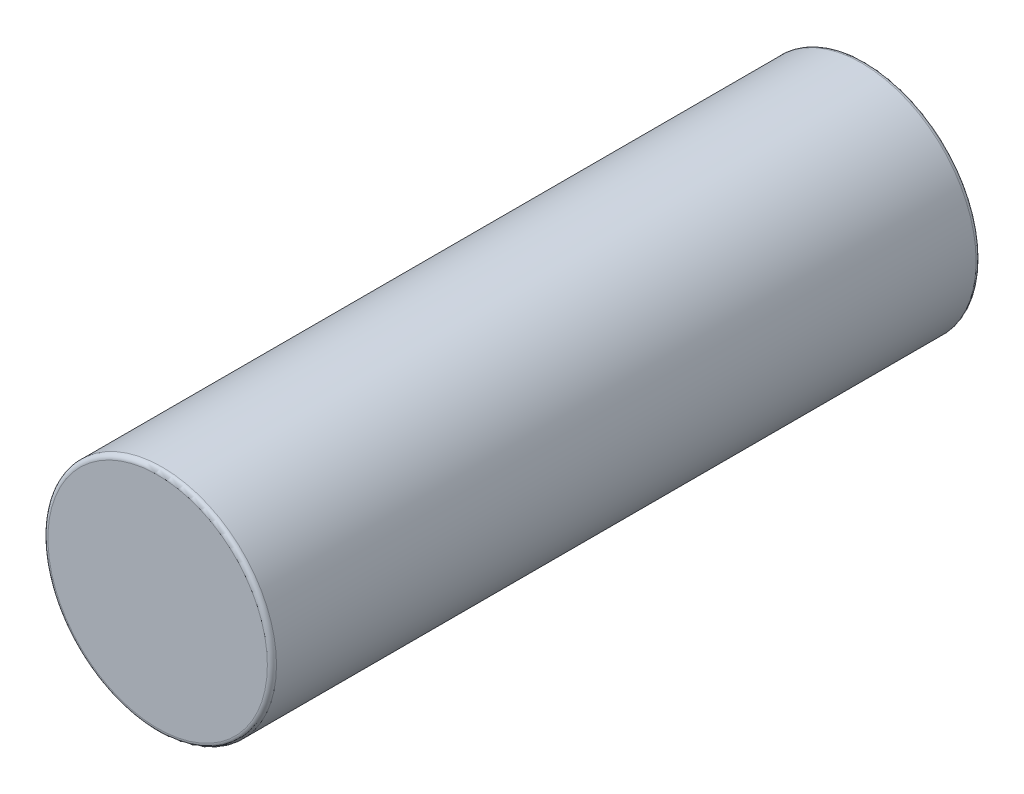
ISO-10303-21;
HEADER;
FILE_DESCRIPTION(('STEP AP214'),'2;1');
FILE_NAME('part.step','',(''),(''),'','','');
FILE_SCHEMA(('AUTOMOTIVE_DESIGN { 1 0 10303 214 1 1 1 1 }'));
ENDSEC;
DATA;
#1=APPLICATION_CONTEXT('core data for automotive mechanical design processes');
#2=APPLICATION_PROTOCOL_DEFINITION('international standard','automotive_design',2000,#1);
#3=PRODUCT_CONTEXT('',#1,'mechanical');
#4=PRODUCT('Part','Part','',(#3));
#5=PRODUCT_RELATED_PRODUCT_CATEGORY('part','',(#4));
#6=PRODUCT_DEFINITION_FORMATION('','',#4);
#7=PRODUCT_DEFINITION_CONTEXT('part definition',#1,'design');
#8=PRODUCT_DEFINITION('design','',#6,#7);
#9=PRODUCT_DEFINITION_SHAPE('','',#8);
#10=(LENGTH_UNIT() NAMED_UNIT(*) SI_UNIT(.MILLI.,.METRE.));
#11=(NAMED_UNIT(*) PLANE_ANGLE_UNIT() SI_UNIT($,.RADIAN.));
#12=(NAMED_UNIT(*) SI_UNIT($,.STERADIAN.) SOLID_ANGLE_UNIT());
#13=UNCERTAINTY_MEASURE_WITH_UNIT(LENGTH_MEASURE(1.E-05),#10,'distance_accuracy_value','');
#14=(GEOMETRIC_REPRESENTATION_CONTEXT(3) GLOBAL_UNCERTAINTY_ASSIGNED_CONTEXT((#13)) GLOBAL_UNIT_ASSIGNED_CONTEXT((#10,
#11,#12)) REPRESENTATION_CONTEXT('',''));
#15=CARTESIAN_POINT('',(0.,0.,0.));
#16=DIRECTION('',(0.,0.,1.));
#17=DIRECTION('',(1.,0.,0.));
#18=AXIS2_PLACEMENT_3D('',#15,#16,#17);
#19=CARTESIAN_POINT('',(0.,0.,-15.5));
#20=DIRECTION('',(0.,0.,1.));
#21=DIRECTION('',(1.,0.,0.));
#22=AXIS2_PLACEMENT_3D('',#19,#20,#21);
#23=CYLINDRICAL_SURFACE('',#22,5.);
#24=CARTESIAN_POINT('',(0.,0.,15.3));
#25=DIRECTION('',(0.,0.,1.));
#26=DIRECTION('',(1.,0.,0.));
#27=AXIS2_PLACEMENT_3D('',#24,#25,#26);
#28=CIRCLE('',#27,5.);
#29=CARTESIAN_POINT('',(5.,0.,15.3));
#30=VERTEX_POINT('',#29);
#31=EDGE_CURVE('E38',#30,#30,#28,.F.);
#32=ORIENTED_EDGE('',*,*,#31,.T.);
#33=EDGE_LOOP('',(#32));
#34=FACE_BOUND('',#33,.T.);
#35=CARTESIAN_POINT('',(0.,0.,-15.3));
#36=DIRECTION('',(0.,0.,1.));
#37=DIRECTION('',(1.,0.,0.));
#38=AXIS2_PLACEMENT_3D('',#35,#36,#37);
#39=CIRCLE('',#38,5.);
#40=CARTESIAN_POINT('',(5.,0.,-15.3));
#41=VERTEX_POINT('',#40);
#42=EDGE_CURVE('E42',#41,#41,#39,.T.);
#43=ORIENTED_EDGE('',*,*,#42,.T.);
#44=EDGE_LOOP('',(#43));
#45=FACE_BOUND('',#44,.T.);
#46=ADVANCED_FACE('F31',(#34,#45),#23,.T.);
#47=CARTESIAN_POINT('',(0.,0.,-15.5));
#48=DIRECTION('',(0.,0.,1.));
#49=DIRECTION('',(1.,0.,0.));
#50=AXIS2_PLACEMENT_3D('',#47,#48,#49);
#51=PLANE('',#50);
#52=CARTESIAN_POINT('',(0.,0.,-15.5));
#53=DIRECTION('',(0.,0.,1.));
#54=DIRECTION('',(1.,0.,0.));
#55=AXIS2_PLACEMENT_3D('',#52,#53,#54);
#56=CIRCLE('',#55,4.8);
#57=CARTESIAN_POINT('',(4.8,0.,-15.5));
#58=VERTEX_POINT('',#57);
#59=EDGE_CURVE('E10',#58,#58,#56,.F.);
#60=ORIENTED_EDGE('',*,*,#59,.T.);
#61=EDGE_LOOP('',(#60));
#62=FACE_BOUND('',#61,.T.);
#63=ADVANCED_FACE('F62',(#62),#51,.F.);
#64=CARTESIAN_POINT('',(0.,0.,15.5));
#65=DIRECTION('',(0.,0.,1.));
#66=DIRECTION('',(1.,0.,0.));
#67=AXIS2_PLACEMENT_3D('',#64,#65,#66);
#68=PLANE('',#67);
#69=CARTESIAN_POINT('',(0.,0.,15.5));
#70=DIRECTION('',(0.,0.,1.));
#71=DIRECTION('',(1.,0.,0.));
#72=AXIS2_PLACEMENT_3D('',#69,#70,#71);
#73=CIRCLE('',#72,4.8);
#74=CARTESIAN_POINT('',(4.8,0.,15.5));
#75=VERTEX_POINT('',#74);
#76=EDGE_CURVE('E46',#75,#75,#73,.T.);
#77=ORIENTED_EDGE('',*,*,#76,.T.);
#78=EDGE_LOOP('',(#77));
#79=FACE_BOUND('',#78,.T.);
#80=ADVANCED_FACE('F52',(#79),#68,.T.);
#81=CARTESIAN_POINT('',(0.,0.,15.3));
#82=DIRECTION('',(0.,0.,1.));
#83=DIRECTION('',(1.,0.,0.));
#84=AXIS2_PLACEMENT_3D('',#81,#82,#83);
#85=TOROIDAL_SURFACE('',#84,4.8,0.2);
#86=ORIENTED_EDGE('',*,*,#31,.F.);
#87=EDGE_LOOP('',(#86));
#88=FACE_BOUND('',#87,.T.);
#89=ORIENTED_EDGE('',*,*,#76,.F.);
#90=EDGE_LOOP('',(#89));
#91=FACE_BOUND('',#90,.T.);
#92=ADVANCED_FACE('F54',(#88,#91),#85,.T.);
#93=CARTESIAN_POINT('',(0.,0.,-15.3));
#94=DIRECTION('',(0.,0.,1.));
#95=DIRECTION('',(1.,0.,0.));
#96=AXIS2_PLACEMENT_3D('',#93,#94,#95);
#97=TOROIDAL_SURFACE('',#96,4.8,0.2);
#98=ORIENTED_EDGE('',*,*,#59,.F.);
#99=EDGE_LOOP('',(#98));
#100=FACE_BOUND('',#99,.T.);
#101=ORIENTED_EDGE('',*,*,#42,.F.);
#102=EDGE_LOOP('',(#101));
#103=FACE_BOUND('',#102,.T.);
#104=ADVANCED_FACE('F33',(#100,#103),#97,.T.);
#105=CLOSED_SHELL('',(#46,#63,#80,#92,#104));
#106=MANIFOLD_SOLID_BREP('B2',#105);
#107=ADVANCED_BREP_SHAPE_REPRESENTATION('',(#18,#106),#14);
#108=SHAPE_DEFINITION_REPRESENTATION(#9,#107);
ENDSEC;
END-ISO-10303-21;
